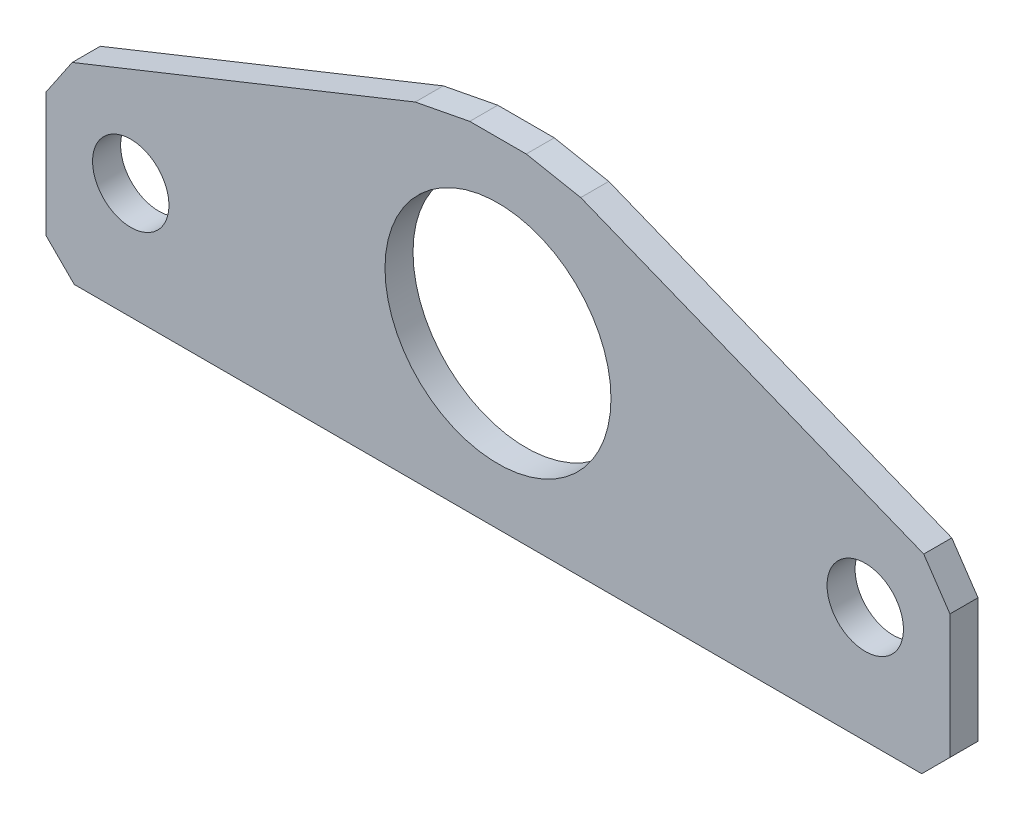
ISO-10303-21;
HEADER;
FILE_DESCRIPTION(('STEP AP214'),'2;1');
FILE_NAME('part.step','',(''),(''),'','','');
FILE_SCHEMA(('AUTOMOTIVE_DESIGN { 1 0 10303 214 1 1 1 1 }'));
ENDSEC;
DATA;
#1=APPLICATION_CONTEXT('core data for automotive mechanical design processes');
#2=APPLICATION_PROTOCOL_DEFINITION('international standard','automotive_design',2000,#1);
#3=PRODUCT_CONTEXT('',#1,'mechanical');
#4=PRODUCT('Part','Part','',(#3));
#5=PRODUCT_RELATED_PRODUCT_CATEGORY('part','',(#4));
#6=PRODUCT_DEFINITION_FORMATION('','',#4);
#7=PRODUCT_DEFINITION_CONTEXT('part definition',#1,'design');
#8=PRODUCT_DEFINITION('design','',#6,#7);
#9=PRODUCT_DEFINITION_SHAPE('','',#8);
#10=(LENGTH_UNIT() NAMED_UNIT(*) SI_UNIT(.MILLI.,.METRE.));
#11=(NAMED_UNIT(*) PLANE_ANGLE_UNIT() SI_UNIT($,.RADIAN.));
#12=(NAMED_UNIT(*) SI_UNIT($,.STERADIAN.) SOLID_ANGLE_UNIT());
#13=UNCERTAINTY_MEASURE_WITH_UNIT(LENGTH_MEASURE(1.E-05),#10,'distance_accuracy_value','');
#14=(GEOMETRIC_REPRESENTATION_CONTEXT(3) GLOBAL_UNCERTAINTY_ASSIGNED_CONTEXT((#13)) GLOBAL_UNIT_ASSIGNED_CONTEXT((#10,
#11,#12)) REPRESENTATION_CONTEXT('',''));
#15=CARTESIAN_POINT('',(0.,0.,0.));
#16=DIRECTION('',(0.,0.,1.));
#17=DIRECTION('',(1.,0.,0.));
#18=AXIS2_PLACEMENT_3D('',#15,#16,#17);
#19=CARTESIAN_POINT('',(25.4,20.955,1.5748));
#20=DIRECTION('',(0.,0.,-1.));
#21=DIRECTION('',(-1.,0.,0.));
#22=AXIS2_PLACEMENT_3D('',#19,#20,#21);
#23=PLANE('',#22);
#24=CARTESIAN_POINT('',(0.,0.,1.5748));
#25=DIRECTION('',(0.,0.,-1.));
#26=DIRECTION('',(-1.,0.,0.));
#27=AXIS2_PLACEMENT_3D('',#24,#25,#26);
#28=CIRCLE('',#27,6.35);
#29=CARTESIAN_POINT('',(-6.35,0.,1.5748));
#30=VERTEX_POINT('',#29);
#31=EDGE_CURVE('E137',#30,#30,#28,.T.);
#32=ORIENTED_EDGE('',*,*,#31,.T.);
#33=EDGE_LOOP('',(#32));
#34=FACE_BOUND('',#33,.T.);
#35=CARTESIAN_POINT('',(20.6375,-3.01285020999999,1.5748));
#36=DIRECTION('',(0.,0.,-1.));
#37=DIRECTION('',(-1.,0.,0.));
#38=AXIS2_PLACEMENT_3D('',#35,#36,#37);
#39=CIRCLE('',#38,2.1463);
#40=CARTESIAN_POINT('',(18.4912,-3.01285020999999,1.5748));
#41=VERTEX_POINT('',#40);
#42=EDGE_CURVE('E139',#41,#41,#39,.T.);
#43=ORIENTED_EDGE('',*,*,#42,.T.);
#44=EDGE_LOOP('',(#43));
#45=FACE_BOUND('',#44,.T.);
#46=DIRECTION('',(0.560628809305184,0.828067230469273,0.));
#47=VECTOR('',#46,1.);
#48=CARTESIAN_POINT('',(-25.4,-0.952500000000011,1.5748));
#49=LINE('',#48,#47);
#50=CARTESIAN_POINT('',(-23.9260432532196,1.22458269871214,1.5748));
#51=VERTEX_POINT('',#50);
#52=CARTESIAN_POINT('',(-25.4,-0.952500000000013,1.5748));
#53=VERTEX_POINT('',#52);
#54=EDGE_CURVE('E118',#51,#53,#49,.F.);
#55=ORIENTED_EDGE('',*,*,#54,.T.);
#56=DIRECTION('',(0.,1.,0.));
#57=VECTOR('',#56,1.);
#58=CARTESIAN_POINT('',(-25.4,0.635,1.5748));
#59=LINE('',#58,#57);
#60=CARTESIAN_POINT('',(-25.4,-7.9375,1.5748));
#61=VERTEX_POINT('',#60);
#62=EDGE_CURVE('E108',#53,#61,#59,.F.);
#63=ORIENTED_EDGE('',*,*,#62,.T.);
#64=DIRECTION('',(-0.707106781186547,0.707106781186548,0.));
#65=VECTOR('',#64,1.);
#66=CARTESIAN_POINT('',(-23.8125,-9.525,1.5748));
#67=LINE('',#66,#65);
#68=CARTESIAN_POINT('',(-23.8125,-9.525,1.5748));
#69=VERTEX_POINT('',#68);
#70=EDGE_CURVE('E141',#61,#69,#67,.F.);
#71=ORIENTED_EDGE('',*,*,#70,.T.);
#72=DIRECTION('',(-1.,0.,0.));
#73=VECTOR('',#72,1.);
#74=CARTESIAN_POINT('',(-25.4,-9.525,1.5748));
#75=LINE('',#74,#73);
#76=CARTESIAN_POINT('',(23.8125,-9.525,1.5748));
#77=VERTEX_POINT('',#76);
#78=EDGE_CURVE('E151',#69,#77,#75,.F.);
#79=ORIENTED_EDGE('',*,*,#78,.T.);
#80=DIRECTION('',(-0.707106781186547,-0.707106781186548,0.));
#81=VECTOR('',#80,1.);
#82=CARTESIAN_POINT('',(25.4,-7.93749999999999,1.5748));
#83=LINE('',#82,#81);
#84=CARTESIAN_POINT('',(25.4,-7.93749999999999,1.5748));
#85=VERTEX_POINT('',#84);
#86=EDGE_CURVE('E155',#77,#85,#83,.F.);
#87=ORIENTED_EDGE('',*,*,#86,.T.);
#88=DIRECTION('',(0.,-1.,0.));
#89=VECTOR('',#88,1.);
#90=CARTESIAN_POINT('',(25.4,0.635000000000006,1.5748));
#91=LINE('',#90,#89);
#92=CARTESIAN_POINT('',(25.4,-0.952500000000005,1.5748));
#93=VERTEX_POINT('',#92);
#94=EDGE_CURVE('E160',#85,#93,#91,.F.);
#95=ORIENTED_EDGE('',*,*,#94,.T.);
#96=DIRECTION('',(0.560628809305184,-0.828067230469273,0.));
#97=VECTOR('',#96,1.);
#98=CARTESIAN_POINT('',(23.9260432532196,1.22458269871215,1.5748));
#99=LINE('',#98,#97);
#100=CARTESIAN_POINT('',(23.9260432532196,1.22458269871215,1.5748));
#101=VERTEX_POINT('',#100);
#102=EDGE_CURVE('E165',#93,#101,#99,.F.);
#103=ORIENTED_EDGE('',*,*,#102,.T.);
#104=DIRECTION('',(0.928476690885259,-0.371390676354104,0.));
#105=VECTOR('',#104,1.);
#106=CARTESIAN_POINT('',(25.4,0.635000000000006,1.5748));
#107=LINE('',#106,#105);
#108=CARTESIAN_POINT('',(4.64895674678047,8.93541730128782,1.5748));
#109=VERTEX_POINT('',#108);
#110=EDGE_CURVE('E170',#101,#109,#107,.F.);
#111=ORIENTED_EDGE('',*,*,#110,.T.);
#112=DIRECTION('',(0.981956386731422,-0.189107521154951,0.));
#113=VECTOR('',#112,1.);
#114=CARTESIAN_POINT('',(1.58749999999997,9.525,1.5748));
#115=LINE('',#114,#113);
#116=CARTESIAN_POINT('',(1.5874999999999,9.525,1.5748));
#117=VERTEX_POINT('',#116);
#118=EDGE_CURVE('E175',#109,#117,#115,.F.);
#119=ORIENTED_EDGE('',*,*,#118,.T.);
#120=DIRECTION('',(1.,0.,0.));
#121=VECTOR('',#120,1.);
#122=CARTESIAN_POINT('',(-3.175,9.525,1.5748));
#123=LINE('',#122,#121);
#124=CARTESIAN_POINT('',(-1.58749999999997,9.525,1.5748));
#125=VERTEX_POINT('',#124);
#126=EDGE_CURVE('E180',#117,#125,#123,.F.);
#127=ORIENTED_EDGE('',*,*,#126,.T.);
#128=DIRECTION('',(0.981956386731422,0.189107521154951,0.));
#129=VECTOR('',#128,1.);
#130=CARTESIAN_POINT('',(-4.64895674678038,8.93541730128785,1.5748));
#131=LINE('',#130,#129);
#132=CARTESIAN_POINT('',(-4.64895674678053,8.93541730128779,1.5748));
#133=VERTEX_POINT('',#132);
#134=EDGE_CURVE('E185',#125,#133,#131,.F.);
#135=ORIENTED_EDGE('',*,*,#134,.T.);
#136=DIRECTION('',(0.928476690885259,0.371390676354104,0.));
#137=VECTOR('',#136,1.);
#138=CARTESIAN_POINT('',(-25.4,0.635,1.5748));
#139=LINE('',#138,#137);
#140=EDGE_CURVE('E103',#133,#51,#139,.F.);
#141=ORIENTED_EDGE('',*,*,#140,.T.);
#142=EDGE_LOOP('',(#55,#63,#71,#79,#87,#95,#103,#111,#119,#127,#135,#141));
#143=FACE_BOUND('',#142,.T.);
#144=CARTESIAN_POINT('',(-20.6375,-3.01285021,1.5748));
#145=DIRECTION('',(0.,0.,-1.));
#146=DIRECTION('',(-1.,0.,0.));
#147=AXIS2_PLACEMENT_3D('',#144,#145,#146);
#148=CIRCLE('',#147,2.1463);
#149=CARTESIAN_POINT('',(-22.7838,-3.01285021,1.5748));
#150=VERTEX_POINT('',#149);
#151=EDGE_CURVE('E20',#150,#150,#148,.T.);
#152=ORIENTED_EDGE('',*,*,#151,.T.);
#153=EDGE_LOOP('',(#152));
#154=FACE_BOUND('',#153,.T.);
#155=ADVANCED_FACE('F17',(#34,#45,#143,#154),#23,.F.);
#156=CARTESIAN_POINT('',(-20.6375,-3.01285021,1.5748));
#157=DIRECTION('',(0.,0.,-1.));
#158=DIRECTION('',(-1.,0.,0.));
#159=AXIS2_PLACEMENT_3D('',#156,#157,#158);
#160=CYLINDRICAL_SURFACE('',#159,2.1463);
#161=ORIENTED_EDGE('',*,*,#151,.F.);
#162=EDGE_LOOP('',(#161));
#163=FACE_BOUND('',#162,.T.);
#164=CARTESIAN_POINT('',(-20.6375,-3.01285021,0.));
#165=DIRECTION('',(0.,0.,-1.));
#166=DIRECTION('',(-1.,0.,0.));
#167=AXIS2_PLACEMENT_3D('',#164,#165,#166);
#168=CIRCLE('',#167,2.1463);
#169=CARTESIAN_POINT('',(-22.7838,-3.01285021,0.));
#170=VERTEX_POINT('',#169);
#171=EDGE_CURVE('E133',#170,#170,#168,.F.);
#172=ORIENTED_EDGE('',*,*,#171,.F.);
#173=EDGE_LOOP('',(#172));
#174=FACE_BOUND('',#173,.T.);
#175=ADVANCED_FACE('F261',(#163,#174),#160,.F.);
#176=CARTESIAN_POINT('',(-25.4,0.635,1.5748));
#177=DIRECTION('',(1.,0.,0.));
#178=DIRECTION('',(0.,0.,-1.));
#179=AXIS2_PLACEMENT_3D('',#176,#177,#178);
#180=PLANE('',#179);
#181=DIRECTION('',(0.,0.,1.));
#182=VECTOR('',#181,1.);
#183=CARTESIAN_POINT('',(-25.4,-0.952500000000011,1.5748));
#184=LINE('',#183,#182);
#185=CARTESIAN_POINT('',(-25.4,-0.952500000000015,0.));
#186=VERTEX_POINT('',#185);
#187=EDGE_CURVE('E111',#53,#186,#184,.F.);
#188=ORIENTED_EDGE('',*,*,#187,.T.);
#189=DIRECTION('',(0.,1.,0.));
#190=VECTOR('',#189,1.);
#191=CARTESIAN_POINT('',(-25.4,20.955,0.));
#192=LINE('',#191,#190);
#193=CARTESIAN_POINT('',(-25.4,-7.9375,0.));
#194=VERTEX_POINT('',#193);
#195=EDGE_CURVE('E136',#194,#186,#192,.T.);
#196=ORIENTED_EDGE('',*,*,#195,.F.);
#197=DIRECTION('',(0.,0.,1.));
#198=VECTOR('',#197,1.);
#199=CARTESIAN_POINT('',(-25.4,-7.9375,1.5748));
#200=LINE('',#199,#198);
#201=EDGE_CURVE('E114',#194,#61,#200,.T.);
#202=ORIENTED_EDGE('',*,*,#201,.T.);
#203=ORIENTED_EDGE('',*,*,#62,.F.);
#204=EDGE_LOOP('',(#188,#196,#202,#203));
#205=FACE_BOUND('',#204,.T.);
#206=ADVANCED_FACE('F109',(#205),#180,.F.);
#207=CARTESIAN_POINT('',(-25.4,-0.952500000000011,1.5748));
#208=DIRECTION('',(0.828067230469273,-0.560628809305184,0.));
#209=DIRECTION('',(0.560628809305184,0.828067230469273,0.));
#210=AXIS2_PLACEMENT_3D('',#207,#208,#209);
#211=PLANE('',#210);
#212=DIRECTION('',(0.,0.,1.));
#213=VECTOR('',#212,1.);
#214=CARTESIAN_POINT('',(-23.9260432532196,1.22458269871214,1.5748));
#215=LINE('',#214,#213);
#216=CARTESIAN_POINT('',(-23.9260432532196,1.22458269871214,0.));
#217=VERTEX_POINT('',#216);
#218=EDGE_CURVE('E189',#51,#217,#215,.F.);
#219=ORIENTED_EDGE('',*,*,#218,.T.);
#220=DIRECTION('',(0.560628809305184,0.828067230469273,0.));
#221=VECTOR('',#220,1.);
#222=CARTESIAN_POINT('',(-25.4,-0.952500000000016,0.));
#223=LINE('',#222,#221);
#224=EDGE_CURVE('E125',#186,#217,#223,.T.);
#225=ORIENTED_EDGE('',*,*,#224,.F.);
#226=ORIENTED_EDGE('',*,*,#187,.F.);
#227=ORIENTED_EDGE('',*,*,#54,.F.);
#228=EDGE_LOOP('',(#219,#225,#226,#227));
#229=FACE_BOUND('',#228,.T.);
#230=ADVANCED_FACE('F123',(#229),#211,.F.);
#231=CARTESIAN_POINT('',(-25.4,0.635,1.5748));
#232=DIRECTION('',(0.371390676354104,-0.928476690885259,0.));
#233=DIRECTION('',(0.928476690885259,0.371390676354104,0.));
#234=AXIS2_PLACEMENT_3D('',#231,#232,#233);
#235=PLANE('',#234);
#236=ORIENTED_EDGE('',*,*,#218,.F.);
#237=ORIENTED_EDGE('',*,*,#140,.F.);
#238=DIRECTION('',(0.,0.,1.));
#239=VECTOR('',#238,1.);
#240=CARTESIAN_POINT('',(-4.64895674678036,8.93541730128785,1.5748));
#241=LINE('',#240,#239);
#242=CARTESIAN_POINT('',(-4.64895674678062,8.93541730128776,0.));
#243=VERTEX_POINT('',#242);
#244=EDGE_CURVE('E187',#133,#243,#241,.F.);
#245=ORIENTED_EDGE('',*,*,#244,.T.);
#246=DIRECTION('',(0.928476690885259,0.371390676354105,0.));
#247=VECTOR('',#246,1.);
#248=CARTESIAN_POINT('',(-23.9260432532196,1.22458269871215,0.));
#249=LINE('',#248,#247);
#250=EDGE_CURVE('E193',#217,#243,#249,.T.);
#251=ORIENTED_EDGE('',*,*,#250,.F.);
#252=EDGE_LOOP('',(#236,#237,#245,#251));
#253=FACE_BOUND('',#252,.T.);
#254=ADVANCED_FACE('F194',(#253),#235,.F.);
#255=CARTESIAN_POINT('',(-4.64895674678038,8.93541730128785,1.5748));
#256=DIRECTION('',(0.189107521154951,-0.981956386731422,0.));
#257=DIRECTION('',(0.981956386731422,0.189107521154951,0.));
#258=AXIS2_PLACEMENT_3D('',#255,#256,#257);
#259=PLANE('',#258);
#260=DIRECTION('',(0.,0.,-1.));
#261=VECTOR('',#260,1.);
#262=CARTESIAN_POINT('',(-1.58749999999998,9.525,1.5748));
#263=LINE('',#262,#261);
#264=CARTESIAN_POINT('',(-1.58749999999997,9.525,0.));
#265=VERTEX_POINT('',#264);
#266=EDGE_CURVE('E183',#125,#265,#263,.T.);
#267=ORIENTED_EDGE('',*,*,#266,.T.);
#268=DIRECTION('',(0.98195638673142,0.189107521154962,0.));
#269=VECTOR('',#268,1.);
#270=CARTESIAN_POINT('',(-4.64895674678072,8.93541730128775,0.));
#271=LINE('',#270,#269);
#272=EDGE_CURVE('E199',#243,#265,#271,.T.);
#273=ORIENTED_EDGE('',*,*,#272,.F.);
#274=ORIENTED_EDGE('',*,*,#244,.F.);
#275=ORIENTED_EDGE('',*,*,#134,.F.);
#276=EDGE_LOOP('',(#267,#273,#274,#275));
#277=FACE_BOUND('',#276,.T.);
#278=ADVANCED_FACE('F277',(#277),#259,.F.);
#279=CARTESIAN_POINT('',(-3.175,9.525,1.5748));
#280=DIRECTION('',(0.,-1.,0.));
#281=DIRECTION('',(0.,0.,-1.));
#282=AXIS2_PLACEMENT_3D('',#279,#280,#281);
#283=PLANE('',#282);
#284=DIRECTION('',(0.,0.,1.));
#285=VECTOR('',#284,1.);
#286=CARTESIAN_POINT('',(1.58749999999994,9.52500000000001,1.5748));
#287=LINE('',#286,#285);
#288=CARTESIAN_POINT('',(1.58749999999984,9.525,0.));
#289=VERTEX_POINT('',#288);
#290=EDGE_CURVE('E178',#117,#289,#287,.F.);
#291=ORIENTED_EDGE('',*,*,#290,.T.);
#292=DIRECTION('',(-1.,0.,0.));
#293=VECTOR('',#292,1.);
#294=CARTESIAN_POINT('',(25.4,9.525,0.));
#295=LINE('',#294,#293);
#296=EDGE_CURVE('E207',#265,#289,#295,.F.);
#297=ORIENTED_EDGE('',*,*,#296,.F.);
#298=ORIENTED_EDGE('',*,*,#266,.F.);
#299=ORIENTED_EDGE('',*,*,#126,.F.);
#300=EDGE_LOOP('',(#291,#297,#298,#299));
#301=FACE_BOUND('',#300,.T.);
#302=ADVANCED_FACE('F280',(#301),#283,.F.);
#303=CARTESIAN_POINT('',(1.58749999999997,9.525,1.5748));
#304=DIRECTION('',(-0.189107521154951,-0.981956386731422,0.));
#305=DIRECTION('',(0.981956386731422,-0.189107521154951,0.));
#306=AXIS2_PLACEMENT_3D('',#303,#304,#305);
#307=PLANE('',#306);
#308=DIRECTION('',(0.,0.,1.));
#309=VECTOR('',#308,1.);
#310=CARTESIAN_POINT('',(4.64895674678057,8.93541730128777,1.5748));
#311=LINE('',#310,#309);
#312=CARTESIAN_POINT('',(4.64895674678042,8.93541730128784,0.));
#313=VERTEX_POINT('',#312);
#314=EDGE_CURVE('E173',#109,#313,#311,.F.);
#315=ORIENTED_EDGE('',*,*,#314,.T.);
#316=DIRECTION('',(0.981956386731423,-0.189107521154944,0.));
#317=VECTOR('',#316,1.);
#318=CARTESIAN_POINT('',(1.58749999999977,9.52500000000002,0.));
#319=LINE('',#318,#317);
#320=EDGE_CURVE('E210',#289,#313,#319,.T.);
#321=ORIENTED_EDGE('',*,*,#320,.F.);
#322=ORIENTED_EDGE('',*,*,#290,.F.);
#323=ORIENTED_EDGE('',*,*,#118,.F.);
#324=EDGE_LOOP('',(#315,#321,#322,#323));
#325=FACE_BOUND('',#324,.T.);
#326=ADVANCED_FACE('F284',(#325),#307,.F.);
#327=CARTESIAN_POINT('',(25.4,0.635000000000006,1.5748));
#328=DIRECTION('',(-0.371390676354104,-0.928476690885259,0.));
#329=DIRECTION('',(0.928476690885259,-0.371390676354104,0.));
#330=AXIS2_PLACEMENT_3D('',#327,#328,#329);
#331=PLANE('',#330);
#332=DIRECTION('',(0.,0.,1.));
#333=VECTOR('',#332,1.);
#334=CARTESIAN_POINT('',(23.9260432532196,1.22458269871215,1.5748));
#335=LINE('',#334,#333);
#336=CARTESIAN_POINT('',(23.9260432532196,1.22458269871215,0.));
#337=VERTEX_POINT('',#336);
#338=EDGE_CURVE('E168',#101,#337,#335,.F.);
#339=ORIENTED_EDGE('',*,*,#338,.T.);
#340=DIRECTION('',(0.928476690885259,-0.371390676354104,0.));
#341=VECTOR('',#340,1.);
#342=CARTESIAN_POINT('',(4.64895674678038,8.93541730128785,0.));
#343=LINE('',#342,#341);
#344=EDGE_CURVE('E213',#313,#337,#343,.T.);
#345=ORIENTED_EDGE('',*,*,#344,.F.);
#346=ORIENTED_EDGE('',*,*,#314,.F.);
#347=ORIENTED_EDGE('',*,*,#110,.F.);
#348=EDGE_LOOP('',(#339,#345,#346,#347));
#349=FACE_BOUND('',#348,.T.);
#350=ADVANCED_FACE('F288',(#349),#331,.F.);
#351=CARTESIAN_POINT('',(23.9260432532196,1.22458269871215,1.5748));
#352=DIRECTION('',(-0.828067230469273,-0.560628809305184,0.));
#353=DIRECTION('',(0.560628809305184,-0.828067230469273,0.));
#354=AXIS2_PLACEMENT_3D('',#351,#352,#353);
#355=PLANE('',#354);
#356=DIRECTION('',(0.,0.,1.));
#357=VECTOR('',#356,1.);
#358=CARTESIAN_POINT('',(25.4,-0.952500000000007,1.5748));
#359=LINE('',#358,#357);
#360=CARTESIAN_POINT('',(25.4,-0.952500000000005,0.));
#361=VERTEX_POINT('',#360);
#362=EDGE_CURVE('E163',#93,#361,#359,.F.);
#363=ORIENTED_EDGE('',*,*,#362,.T.);
#364=DIRECTION('',(0.560628809305184,-0.828067230469273,0.));
#365=VECTOR('',#364,1.);
#366=CARTESIAN_POINT('',(23.9260432532196,1.22458269871215,0.));
#367=LINE('',#366,#365);
#368=EDGE_CURVE('E216',#337,#361,#367,.T.);
#369=ORIENTED_EDGE('',*,*,#368,.F.);
#370=ORIENTED_EDGE('',*,*,#338,.F.);
#371=ORIENTED_EDGE('',*,*,#102,.F.);
#372=EDGE_LOOP('',(#363,#369,#370,#371));
#373=FACE_BOUND('',#372,.T.);
#374=ADVANCED_FACE('F292',(#373),#355,.F.);
#375=CARTESIAN_POINT('',(25.4,0.635000000000006,1.5748));
#376=DIRECTION('',(-1.,0.,0.));
#377=DIRECTION('',(0.,-1.,0.));
#378=AXIS2_PLACEMENT_3D('',#375,#376,#377);
#379=PLANE('',#378);
#380=DIRECTION('',(0.,0.,1.));
#381=VECTOR('',#380,1.);
#382=CARTESIAN_POINT('',(25.4,-7.93749999999999,1.5748));
#383=LINE('',#382,#381);
#384=CARTESIAN_POINT('',(25.4,-7.93749999999999,0.));
#385=VERTEX_POINT('',#384);
#386=EDGE_CURVE('E158',#85,#385,#383,.F.);
#387=ORIENTED_EDGE('',*,*,#386,.T.);
#388=DIRECTION('',(0.,1.,0.));
#389=VECTOR('',#388,1.);
#390=CARTESIAN_POINT('',(25.4,20.955,0.));
#391=LINE('',#390,#389);
#392=EDGE_CURVE('E219',#361,#385,#391,.F.);
#393=ORIENTED_EDGE('',*,*,#392,.F.);
#394=ORIENTED_EDGE('',*,*,#362,.F.);
#395=ORIENTED_EDGE('',*,*,#94,.F.);
#396=EDGE_LOOP('',(#387,#393,#394,#395));
#397=FACE_BOUND('',#396,.T.);
#398=ADVANCED_FACE('F296',(#397),#379,.F.);
#399=CARTESIAN_POINT('',(25.4,-7.93749999999999,1.5748));
#400=DIRECTION('',(-0.707106781186548,0.707106781186547,0.));
#401=DIRECTION('',(-0.707106781186547,-0.707106781186548,0.));
#402=AXIS2_PLACEMENT_3D('',#399,#400,#401);
#403=PLANE('',#402);
#404=DIRECTION('',(0.,0.,1.));
#405=VECTOR('',#404,1.);
#406=CARTESIAN_POINT('',(23.8125,-9.52499999999999,1.5748));
#407=LINE('',#406,#405);
#408=CARTESIAN_POINT('',(23.8125,-9.525,0.));
#409=VERTEX_POINT('',#408);
#410=EDGE_CURVE('E153',#77,#409,#407,.F.);
#411=ORIENTED_EDGE('',*,*,#410,.T.);
#412=DIRECTION('',(-0.707106781186546,-0.707106781186549,0.));
#413=VECTOR('',#412,1.);
#414=CARTESIAN_POINT('',(25.4,-7.93749999999999,0.));
#415=LINE('',#414,#413);
#416=EDGE_CURVE('E222',#385,#409,#415,.T.);
#417=ORIENTED_EDGE('',*,*,#416,.F.);
#418=ORIENTED_EDGE('',*,*,#386,.F.);
#419=ORIENTED_EDGE('',*,*,#86,.F.);
#420=EDGE_LOOP('',(#411,#417,#418,#419));
#421=FACE_BOUND('',#420,.T.);
#422=ADVANCED_FACE('F241',(#421),#403,.F.);
#423=CARTESIAN_POINT('',(-25.4,-9.525,1.5748));
#424=DIRECTION('',(0.,1.,0.));
#425=DIRECTION('',(-1.,0.,0.));
#426=AXIS2_PLACEMENT_3D('',#423,#424,#425);
#427=PLANE('',#426);
#428=DIRECTION('',(0.,0.,1.));
#429=VECTOR('',#428,1.);
#430=CARTESIAN_POINT('',(-23.8125,-9.525,1.5748));
#431=LINE('',#430,#429);
#432=CARTESIAN_POINT('',(-23.8125,-9.525,0.));
#433=VERTEX_POINT('',#432);
#434=EDGE_CURVE('E35',#69,#433,#431,.F.);
#435=ORIENTED_EDGE('',*,*,#434,.T.);
#436=DIRECTION('',(-1.,0.,0.));
#437=VECTOR('',#436,1.);
#438=CARTESIAN_POINT('',(25.4,-9.525,0.));
#439=LINE('',#438,#437);
#440=EDGE_CURVE('E225',#409,#433,#439,.T.);
#441=ORIENTED_EDGE('',*,*,#440,.F.);
#442=ORIENTED_EDGE('',*,*,#410,.F.);
#443=ORIENTED_EDGE('',*,*,#78,.F.);
#444=EDGE_LOOP('',(#435,#441,#442,#443));
#445=FACE_BOUND('',#444,.T.);
#446=ADVANCED_FACE('F231',(#445),#427,.F.);
#447=CARTESIAN_POINT('',(-23.8125,-9.525,1.5748));
#448=DIRECTION('',(0.707106781186548,0.707106781186547,0.));
#449=DIRECTION('',(-0.707106781186547,0.707106781186548,0.));
#450=AXIS2_PLACEMENT_3D('',#447,#448,#449);
#451=PLANE('',#450);
#452=ORIENTED_EDGE('',*,*,#201,.F.);
#453=DIRECTION('',(-0.707106781186544,0.707106781186551,0.));
#454=VECTOR('',#453,1.);
#455=CARTESIAN_POINT('',(-23.8125,-9.525,0.));
#456=LINE('',#455,#454);
#457=EDGE_CURVE('E132',#433,#194,#456,.T.);
#458=ORIENTED_EDGE('',*,*,#457,.F.);
#459=ORIENTED_EDGE('',*,*,#434,.F.);
#460=ORIENTED_EDGE('',*,*,#70,.F.);
#461=EDGE_LOOP('',(#452,#458,#459,#460));
#462=FACE_BOUND('',#461,.T.);
#463=ADVANCED_FACE('F228',(#462),#451,.F.);
#464=CARTESIAN_POINT('',(20.6375,-3.01285020999999,1.5748));
#465=DIRECTION('',(0.,0.,-1.));
#466=DIRECTION('',(-1.,0.,0.));
#467=AXIS2_PLACEMENT_3D('',#464,#465,#466);
#468=CYLINDRICAL_SURFACE('',#467,2.1463);
#469=ORIENTED_EDGE('',*,*,#42,.F.);
#470=EDGE_LOOP('',(#469));
#471=FACE_BOUND('',#470,.T.);
#472=CARTESIAN_POINT('',(20.6375,-3.01285020999999,0.));
#473=DIRECTION('',(0.,0.,-1.));
#474=DIRECTION('',(-1.,0.,0.));
#475=AXIS2_PLACEMENT_3D('',#472,#473,#474);
#476=CIRCLE('',#475,2.1463);
#477=CARTESIAN_POINT('',(18.4912,-3.01285020999999,0.));
#478=VERTEX_POINT('',#477);
#479=EDGE_CURVE('E26',#478,#478,#476,.F.);
#480=ORIENTED_EDGE('',*,*,#479,.F.);
#481=EDGE_LOOP('',(#480));
#482=FACE_BOUND('',#481,.T.);
#483=ADVANCED_FACE('F230',(#471,#482),#468,.F.);
#484=CARTESIAN_POINT('',(0.,0.,1.5748));
#485=DIRECTION('',(0.,0.,-1.));
#486=DIRECTION('',(-1.,0.,0.));
#487=AXIS2_PLACEMENT_3D('',#484,#485,#486);
#488=CYLINDRICAL_SURFACE('',#487,6.35);
#489=ORIENTED_EDGE('',*,*,#31,.F.);
#490=EDGE_LOOP('',(#489));
#491=FACE_BOUND('',#490,.T.);
#492=CARTESIAN_POINT('',(0.,0.,0.));
#493=DIRECTION('',(0.,0.,-1.));
#494=DIRECTION('',(-1.,0.,0.));
#495=AXIS2_PLACEMENT_3D('',#492,#493,#494);
#496=CIRCLE('',#495,6.35);
#497=CARTESIAN_POINT('',(-6.35,0.,0.));
#498=VERTEX_POINT('',#497);
#499=EDGE_CURVE('E11',#498,#498,#496,.F.);
#500=ORIENTED_EDGE('',*,*,#499,.F.);
#501=EDGE_LOOP('',(#500));
#502=FACE_BOUND('',#501,.T.);
#503=ADVANCED_FACE('F238',(#491,#502),#488,.F.);
#504=CARTESIAN_POINT('',(25.4,20.955,0.));
#505=DIRECTION('',(0.,0.,-1.));
#506=DIRECTION('',(-1.,0.,0.));
#507=AXIS2_PLACEMENT_3D('',#504,#505,#506);
#508=PLANE('',#507);
#509=ORIENTED_EDGE('',*,*,#499,.T.);
#510=EDGE_LOOP('',(#509));
#511=FACE_BOUND('',#510,.T.);
#512=ORIENTED_EDGE('',*,*,#479,.T.);
#513=EDGE_LOOP('',(#512));
#514=FACE_BOUND('',#513,.T.);
#515=ORIENTED_EDGE('',*,*,#440,.T.);
#516=ORIENTED_EDGE('',*,*,#457,.T.);
#517=ORIENTED_EDGE('',*,*,#195,.T.);
#518=ORIENTED_EDGE('',*,*,#224,.T.);
#519=ORIENTED_EDGE('',*,*,#250,.T.);
#520=ORIENTED_EDGE('',*,*,#272,.T.);
#521=ORIENTED_EDGE('',*,*,#296,.T.);
#522=ORIENTED_EDGE('',*,*,#320,.T.);
#523=ORIENTED_EDGE('',*,*,#344,.T.);
#524=ORIENTED_EDGE('',*,*,#368,.T.);
#525=ORIENTED_EDGE('',*,*,#392,.T.);
#526=ORIENTED_EDGE('',*,*,#416,.T.);
#527=EDGE_LOOP('',(#515,#516,#517,#518,#519,#520,#521,#522,#523,#524,#525,#526));
#528=FACE_BOUND('',#527,.T.);
#529=ORIENTED_EDGE('',*,*,#171,.T.);
#530=EDGE_LOOP('',(#529));
#531=FACE_BOUND('',#530,.T.);
#532=ADVANCED_FACE('F202',(#511,#514,#528,#531),#508,.T.);
#533=CLOSED_SHELL('',(#155,#175,#206,#230,#254,#278,#302,#326,#350,#374,#398,#422,#446,#463,
#483,#503,#532));
#534=MANIFOLD_SOLID_BREP('B1',#533);
#535=ADVANCED_BREP_SHAPE_REPRESENTATION('',(#18,#534),#14);
#536=SHAPE_DEFINITION_REPRESENTATION(#9,#535);
ENDSEC;
END-ISO-10303-21;
